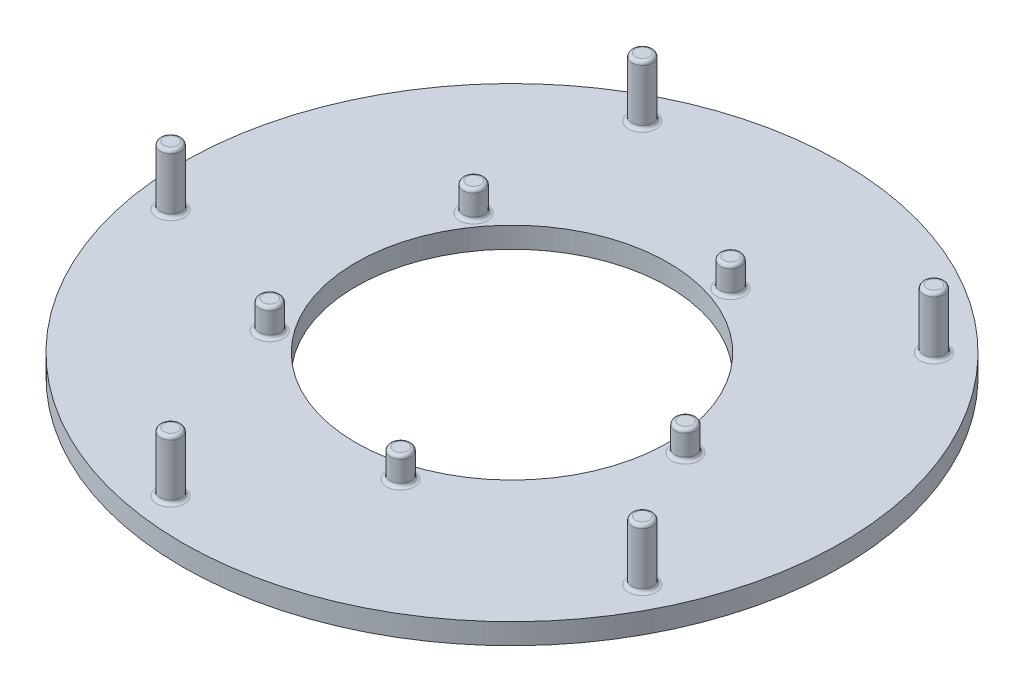
ISO-10303-21;
HEADER;
FILE_DESCRIPTION(('STEP AP214'),'2;1');
FILE_NAME('part.step','',(''),(''),'','','');
FILE_SCHEMA(('AUTOMOTIVE_DESIGN { 1 0 10303 214 1 1 1 1 }'));
ENDSEC;
DATA;
#1=APPLICATION_CONTEXT('core data for automotive mechanical design processes');
#2=APPLICATION_PROTOCOL_DEFINITION('international standard','automotive_design',2000,#1);
#3=PRODUCT_CONTEXT('',#1,'mechanical');
#4=PRODUCT('Part','Part','',(#3));
#5=PRODUCT_RELATED_PRODUCT_CATEGORY('part','',(#4));
#6=PRODUCT_DEFINITION_FORMATION('','',#4);
#7=PRODUCT_DEFINITION_CONTEXT('part definition',#1,'design');
#8=PRODUCT_DEFINITION('design','',#6,#7);
#9=PRODUCT_DEFINITION_SHAPE('','',#8);
#10=(LENGTH_UNIT() NAMED_UNIT(*) SI_UNIT(.MILLI.,.METRE.));
#11=(NAMED_UNIT(*) PLANE_ANGLE_UNIT() SI_UNIT($,.RADIAN.));
#12=(NAMED_UNIT(*) SI_UNIT($,.STERADIAN.) SOLID_ANGLE_UNIT());
#13=UNCERTAINTY_MEASURE_WITH_UNIT(LENGTH_MEASURE(1.E-05),#10,'distance_accuracy_value','');
#14=(GEOMETRIC_REPRESENTATION_CONTEXT(3) GLOBAL_UNCERTAINTY_ASSIGNED_CONTEXT((#13)) GLOBAL_UNIT_ASSIGNED_CONTEXT((#10,
#11,#12)) REPRESENTATION_CONTEXT('',''));
#15=CARTESIAN_POINT('',(0.,0.,0.));
#16=DIRECTION('',(0.,0.,1.));
#17=DIRECTION('',(1.,0.,0.));
#18=AXIS2_PLACEMENT_3D('',#15,#16,#17);
#19=CARTESIAN_POINT('',(0.,3.,0.));
#20=DIRECTION('',(0.,1.,0.));
#21=DIRECTION('',(0.,0.,1.));
#22=AXIS2_PLACEMENT_3D('',#19,#20,#21);
#23=PLANE('',#22);
#24=CARTESIAN_POINT('',(38.3132805401001,3.,19.5215914888));
#25=DIRECTION('',(0.,1.,0.));
#26=DIRECTION('',(0.,0.,1.));
#27=AXIS2_PLACEMENT_3D('',#24,#25,#26);
#28=CIRCLE('',#27,2.00000000000001);
#29=CARTESIAN_POINT('',(38.3132805401001,3.,21.5215914888));
#30=VERTEX_POINT('',#29);
#31=EDGE_CURVE('E79',#30,#30,#28,.F.);
#32=ORIENTED_EDGE('',*,*,#31,.T.);
#33=EDGE_LOOP('',(#32));
#34=FACE_BOUND('',#33,.T.);
#35=CARTESIAN_POINT('',(7.72542485937396,3.,23.7764129073788));
#36=DIRECTION('',(0.,1.,0.));
#37=DIRECTION('',(0.,0.,1.));
#38=AXIS2_PLACEMENT_3D('',#35,#36,#37);
#39=CIRCLE('',#38,2.);
#40=CARTESIAN_POINT('',(7.72542485937396,3.,25.7764129073788));
#41=VERTEX_POINT('',#40);
#42=EDGE_CURVE('E83',#41,#41,#39,.F.);
#43=ORIENTED_EDGE('',*,*,#42,.T.);
#44=EDGE_LOOP('',(#43));
#45=FACE_BOUND('',#44,.T.);
#46=CARTESIAN_POINT('',(-6.72668199672947,3.,42.470598645591));
#47=DIRECTION('',(0.,1.,0.));
#48=DIRECTION('',(0.,0.,1.));
#49=AXIS2_PLACEMENT_3D('',#46,#47,#48);
#50=CIRCLE('',#49,2.00000000000001);
#51=CARTESIAN_POINT('',(-6.72668199672947,3.,44.470598645591));
#52=VERTEX_POINT('',#51);
#53=EDGE_CURVE('E103',#52,#52,#50,.F.);
#54=ORIENTED_EDGE('',*,*,#53,.T.);
#55=EDGE_LOOP('',(#54));
#56=FACE_BOUND('',#55,.T.);
#57=CARTESIAN_POINT('',(-20.2254248593736,3.,14.694631307312));
#58=DIRECTION('',(0.,1.,0.));
#59=DIRECTION('',(0.,0.,1.));
#60=AXIS2_PLACEMENT_3D('',#57,#58,#59);
#61=CIRCLE('',#60,2.);
#62=CARTESIAN_POINT('',(-20.2254248593736,3.,16.694631307312));
#63=VERTEX_POINT('',#62);
#64=EDGE_CURVE('E107',#63,#63,#61,.F.);
#65=ORIENTED_EDGE('',*,*,#64,.T.);
#66=EDGE_LOOP('',(#65));
#67=FACE_BOUND('',#66,.T.);
#68=CARTESIAN_POINT('',(-42.4705986455909,3.,6.72668199673025));
#69=DIRECTION('',(0.,1.,0.));
#70=DIRECTION('',(0.,0.,1.));
#71=AXIS2_PLACEMENT_3D('',#68,#69,#70);
#72=CIRCLE('',#71,2.00000000000001);
#73=CARTESIAN_POINT('',(-42.4705986455909,3.,8.72668199673025));
#74=VERTEX_POINT('',#73);
#75=EDGE_CURVE('E127',#74,#74,#72,.F.);
#76=ORIENTED_EDGE('',*,*,#75,.T.);
#77=EDGE_LOOP('',(#76));
#78=FACE_BOUND('',#77,.T.);
#79=CARTESIAN_POINT('',(-20.2254248593738,3.,-14.6946313073117));
#80=DIRECTION('',(0.,1.,0.));
#81=DIRECTION('',(0.,0.,1.));
#82=AXIS2_PLACEMENT_3D('',#79,#80,#81);
#83=CIRCLE('',#82,2.);
#84=CARTESIAN_POINT('',(-20.2254248593738,3.,-12.6946313073117));
#85=VERTEX_POINT('',#84);
#86=EDGE_CURVE('E131',#85,#85,#83,.F.);
#87=ORIENTED_EDGE('',*,*,#86,.T.);
#88=EDGE_LOOP('',(#87));
#89=FACE_BOUND('',#88,.T.);
#90=CARTESIAN_POINT('',(-19.5215914888007,3.,-38.3132805400997));
#91=DIRECTION('',(0.,1.,0.));
#92=DIRECTION('',(0.,0.,1.));
#93=AXIS2_PLACEMENT_3D('',#90,#91,#92);
#94=CIRCLE('',#93,2.00000000000001);
#95=CARTESIAN_POINT('',(-19.5215914888007,3.,-36.3132805400997));
#96=VERTEX_POINT('',#95);
#97=EDGE_CURVE('E151',#96,#96,#94,.F.);
#98=ORIENTED_EDGE('',*,*,#97,.T.);
#99=EDGE_LOOP('',(#98));
#100=FACE_BOUND('',#99,.T.);
#101=CARTESIAN_POINT('',(7.72542485937362,3.,-23.7764129073789));
#102=DIRECTION('',(0.,1.,0.));
#103=DIRECTION('',(0.,0.,1.));
#104=AXIS2_PLACEMENT_3D('',#101,#102,#103);
#105=CIRCLE('',#104,2.);
#106=CARTESIAN_POINT('',(7.72542485937362,3.,-21.7764129073789));
#107=VERTEX_POINT('',#106);
#108=EDGE_CURVE('E155',#107,#107,#105,.F.);
#109=ORIENTED_EDGE('',*,*,#108,.T.);
#110=EDGE_LOOP('',(#109));
#111=FACE_BOUND('',#110,.T.);
#112=CARTESIAN_POINT('',(30.4055915910215,3.,-30.4055915910216));
#113=DIRECTION('',(0.,1.,0.));
#114=DIRECTION('',(0.,0.,1.));
#115=AXIS2_PLACEMENT_3D('',#112,#113,#114);
#116=CIRCLE('',#115,2.00000000000001);
#117=CARTESIAN_POINT('',(30.4055915910215,3.,-28.4055915910216));
#118=VERTEX_POINT('',#117);
#119=EDGE_CURVE('E183',#118,#118,#116,.F.);
#120=ORIENTED_EDGE('',*,*,#119,.T.);
#121=EDGE_LOOP('',(#120));
#122=FACE_BOUND('',#121,.T.);
#123=CARTESIAN_POINT('',(25.,3.,0.));
#124=DIRECTION('',(0.,1.,0.));
#125=DIRECTION('',(0.,0.,1.));
#126=AXIS2_PLACEMENT_3D('',#123,#124,#125);
#127=CIRCLE('',#126,2.);
#128=CARTESIAN_POINT('',(25.,3.,2.));
#129=VERTEX_POINT('',#128);
#130=EDGE_CURVE('E187',#129,#129,#127,.F.);
#131=ORIENTED_EDGE('',*,*,#130,.T.);
#132=EDGE_LOOP('',(#131));
#133=FACE_BOUND('',#132,.T.);
#134=CARTESIAN_POINT('',(0.,3.,0.));
#135=DIRECTION('',(0.,1.,0.));
#136=DIRECTION('',(0.,0.,1.));
#137=AXIS2_PLACEMENT_3D('',#134,#135,#136);
#138=CIRCLE('',#137,47.5);
#139=CARTESIAN_POINT('',(0.,3.,47.5));
#140=VERTEX_POINT('',#139);
#141=EDGE_CURVE('E207',#140,#140,#138,.T.);
#142=ORIENTED_EDGE('',*,*,#141,.T.);
#143=EDGE_LOOP('',(#142));
#144=FACE_BOUND('',#143,.T.);
#145=CARTESIAN_POINT('',(0.,3.,0.));
#146=DIRECTION('',(0.,1.,0.));
#147=DIRECTION('',(0.,0.,1.));
#148=AXIS2_PLACEMENT_3D('',#145,#146,#147);
#149=CIRCLE('',#148,22.5);
#150=CARTESIAN_POINT('',(0.,3.,22.5));
#151=VERTEX_POINT('',#150);
#152=EDGE_CURVE('E212',#151,#151,#149,.T.);
#153=ORIENTED_EDGE('',*,*,#152,.F.);
#154=EDGE_LOOP('',(#153));
#155=FACE_BOUND('',#154,.T.);
#156=ADVANCED_FACE('F39',(#34,#45,#56,#67,#78,#89,#100,#111,#122,#133,#144,#155),#23,.T.);
#157=CARTESIAN_POINT('',(0.,0.,0.));
#158=DIRECTION('',(0.,1.,0.));
#159=DIRECTION('',(0.,0.,1.));
#160=AXIS2_PLACEMENT_3D('',#157,#158,#159);
#161=PLANE('',#160);
#162=CARTESIAN_POINT('',(0.,0.,0.));
#163=DIRECTION('',(0.,1.,0.));
#164=DIRECTION('',(0.,0.,1.));
#165=AXIS2_PLACEMENT_3D('',#162,#163,#164);
#166=CIRCLE('',#165,47.5);
#167=CARTESIAN_POINT('',(0.,0.,47.5));
#168=VERTEX_POINT('',#167);
#169=EDGE_CURVE('E208',#168,#168,#166,.T.);
#170=ORIENTED_EDGE('',*,*,#169,.F.);
#171=EDGE_LOOP('',(#170));
#172=FACE_BOUND('',#171,.T.);
#173=CARTESIAN_POINT('',(0.,0.,0.));
#174=DIRECTION('',(0.,1.,0.));
#175=DIRECTION('',(0.,0.,1.));
#176=AXIS2_PLACEMENT_3D('',#173,#174,#175);
#177=CIRCLE('',#176,22.5);
#178=CARTESIAN_POINT('',(0.,0.,22.5));
#179=VERTEX_POINT('',#178);
#180=EDGE_CURVE('E216',#179,#179,#177,.T.);
#181=ORIENTED_EDGE('',*,*,#180,.T.);
#182=EDGE_LOOP('',(#181));
#183=FACE_BOUND('',#182,.T.);
#184=ADVANCED_FACE('F228',(#172,#183),#161,.F.);
#185=CARTESIAN_POINT('',(0.,3.,0.));
#186=DIRECTION('',(0.,-1.,0.));
#187=DIRECTION('',(0.,0.,-1.));
#188=AXIS2_PLACEMENT_3D('',#185,#186,#187);
#189=CYLINDRICAL_SURFACE('',#188,47.5);
#190=ORIENTED_EDGE('',*,*,#141,.F.);
#191=EDGE_LOOP('',(#190));
#192=FACE_BOUND('',#191,.T.);
#193=ORIENTED_EDGE('',*,*,#169,.T.);
#194=EDGE_LOOP('',(#193));
#195=FACE_BOUND('',#194,.T.);
#196=ADVANCED_FACE('F234',(#192,#195),#189,.T.);
#197=CARTESIAN_POINT('',(0.,3.,0.));
#198=DIRECTION('',(0.,-1.,0.));
#199=DIRECTION('',(0.,0.,-1.));
#200=AXIS2_PLACEMENT_3D('',#197,#198,#199);
#201=CYLINDRICAL_SURFACE('',#200,22.5);
#202=ORIENTED_EDGE('',*,*,#152,.T.);
#203=EDGE_LOOP('',(#202));
#204=FACE_BOUND('',#203,.T.);
#205=ORIENTED_EDGE('',*,*,#180,.F.);
#206=EDGE_LOOP('',(#205));
#207=FACE_BOUND('',#206,.T.);
#208=ADVANCED_FACE('F224',(#204,#207),#201,.F.);
#209=CARTESIAN_POINT('',(25.,7.,0.));
#210=DIRECTION('',(0.,-1.,0.));
#211=DIRECTION('',(0.,0.,-1.));
#212=AXIS2_PLACEMENT_3D('',#209,#210,#211);
#213=CYLINDRICAL_SURFACE('',#212,1.5);
#214=CARTESIAN_POINT('',(25.,6.5,0.));
#215=DIRECTION('',(0.,1.,0.));
#216=DIRECTION('',(0.,0.,1.));
#217=AXIS2_PLACEMENT_3D('',#214,#215,#216);
#218=CIRCLE('',#217,1.5);
#219=CARTESIAN_POINT('',(25.,6.5,1.5));
#220=VERTEX_POINT('',#219);
#221=EDGE_CURVE('E195',#220,#220,#218,.F.);
#222=ORIENTED_EDGE('',*,*,#221,.T.);
#223=EDGE_LOOP('',(#222));
#224=FACE_BOUND('',#223,.T.);
#225=CARTESIAN_POINT('',(25.,3.5,0.));
#226=DIRECTION('',(0.,1.,0.));
#227=DIRECTION('',(0.,0.,1.));
#228=AXIS2_PLACEMENT_3D('',#225,#226,#227);
#229=CIRCLE('',#228,1.5);
#230=CARTESIAN_POINT('',(25.,3.5,1.5));
#231=VERTEX_POINT('',#230);
#232=EDGE_CURVE('E199',#231,#231,#229,.T.);
#233=ORIENTED_EDGE('',*,*,#232,.T.);
#234=EDGE_LOOP('',(#233));
#235=FACE_BOUND('',#234,.T.);
#236=ADVANCED_FACE('F400',(#224,#235),#213,.T.);
#237=CARTESIAN_POINT('',(25.,7.,0.));
#238=DIRECTION('',(0.,1.,0.));
#239=DIRECTION('',(0.,0.,1.));
#240=AXIS2_PLACEMENT_3D('',#237,#238,#239);
#241=PLANE('',#240);
#242=CARTESIAN_POINT('',(25.,7.,0.));
#243=DIRECTION('',(0.,1.,0.));
#244=DIRECTION('',(0.,0.,1.));
#245=AXIS2_PLACEMENT_3D('',#242,#243,#244);
#246=CIRCLE('',#245,1.);
#247=CARTESIAN_POINT('',(25.,7.,1.));
#248=VERTEX_POINT('',#247);
#249=EDGE_CURVE('E203',#248,#248,#246,.T.);
#250=ORIENTED_EDGE('',*,*,#249,.T.);
#251=EDGE_LOOP('',(#250));
#252=FACE_BOUND('',#251,.T.);
#253=ADVANCED_FACE('F397',(#252),#241,.T.);
#254=CARTESIAN_POINT('',(30.4055915910215,7.,-30.4055915910216));
#255=DIRECTION('',(0.,-1.,0.));
#256=DIRECTION('',(0.,0.,-1.));
#257=AXIS2_PLACEMENT_3D('',#254,#255,#256);
#258=CYLINDRICAL_SURFACE('',#257,1.50000000000001);
#259=CARTESIAN_POINT('',(30.4055915910215,11.,-30.4055915910216));
#260=DIRECTION('',(0.,1.,0.));
#261=DIRECTION('',(0.,0.,1.));
#262=AXIS2_PLACEMENT_3D('',#259,#260,#261);
#263=CIRCLE('',#262,1.50000000000001);
#264=CARTESIAN_POINT('',(30.4055915910215,11.,-28.9055915910216));
#265=VERTEX_POINT('',#264);
#266=EDGE_CURVE('E175',#265,#265,#263,.F.);
#267=ORIENTED_EDGE('',*,*,#266,.T.);
#268=EDGE_LOOP('',(#267));
#269=FACE_BOUND('',#268,.T.);
#270=CARTESIAN_POINT('',(30.4055915910215,3.5,-30.4055915910216));
#271=DIRECTION('',(0.,1.,0.));
#272=DIRECTION('',(0.,0.,1.));
#273=AXIS2_PLACEMENT_3D('',#270,#271,#272);
#274=CIRCLE('',#273,1.50000000000001);
#275=CARTESIAN_POINT('',(30.4055915910215,3.5,-28.9055915910216));
#276=VERTEX_POINT('',#275);
#277=EDGE_CURVE('E191',#276,#276,#274,.T.);
#278=ORIENTED_EDGE('',*,*,#277,.T.);
#279=EDGE_LOOP('',(#278));
#280=FACE_BOUND('',#279,.T.);
#281=ADVANCED_FACE('F248',(#269,#280),#258,.T.);
#282=CARTESIAN_POINT('',(25.,6.5,0.));
#283=DIRECTION('',(0.,1.,0.));
#284=DIRECTION('',(0.,0.,1.));
#285=AXIS2_PLACEMENT_3D('',#282,#283,#284);
#286=TOROIDAL_SURFACE('',#285,1.,0.5);
#287=ORIENTED_EDGE('',*,*,#221,.F.);
#288=EDGE_LOOP('',(#287));
#289=FACE_BOUND('',#288,.T.);
#290=ORIENTED_EDGE('',*,*,#249,.F.);
#291=EDGE_LOOP('',(#290));
#292=FACE_BOUND('',#291,.T.);
#293=ADVANCED_FACE('F244',(#289,#292),#286,.T.);
#294=CARTESIAN_POINT('',(30.4055915910215,3.5,-30.4055915910216));
#295=DIRECTION('',(0.,1.,0.));
#296=DIRECTION('',(0.,0.,1.));
#297=AXIS2_PLACEMENT_3D('',#294,#295,#296);
#298=TOROIDAL_SURFACE('',#297,2.00000000000001,0.5);
#299=ORIENTED_EDGE('',*,*,#119,.F.);
#300=EDGE_LOOP('',(#299));
#301=FACE_BOUND('',#300,.T.);
#302=ORIENTED_EDGE('',*,*,#277,.F.);
#303=EDGE_LOOP('',(#302));
#304=FACE_BOUND('',#303,.T.);
#305=ADVANCED_FACE('F247',(#301,#304),#298,.F.);
#306=CARTESIAN_POINT('',(25.,3.5,0.));
#307=DIRECTION('',(0.,1.,0.));
#308=DIRECTION('',(0.,0.,1.));
#309=AXIS2_PLACEMENT_3D('',#306,#307,#308);
#310=TOROIDAL_SURFACE('',#309,2.,0.5);
#311=ORIENTED_EDGE('',*,*,#130,.F.);
#312=EDGE_LOOP('',(#311));
#313=FACE_BOUND('',#312,.T.);
#314=ORIENTED_EDGE('',*,*,#232,.F.);
#315=EDGE_LOOP('',(#314));
#316=FACE_BOUND('',#315,.T.);
#317=ADVANCED_FACE('F252',(#313,#316),#310,.F.);
#318=CARTESIAN_POINT('',(30.4055915910215,11.5,-30.4055915910216));
#319=DIRECTION('',(0.,1.,0.));
#320=DIRECTION('',(0.,0.,1.));
#321=AXIS2_PLACEMENT_3D('',#318,#319,#320);
#322=PLANE('',#321);
#323=CARTESIAN_POINT('',(30.4055915910215,11.5,-30.4055915910216));
#324=DIRECTION('',(0.,1.,0.));
#325=DIRECTION('',(0.,0.,1.));
#326=AXIS2_PLACEMENT_3D('',#323,#324,#325);
#327=CIRCLE('',#326,1.00000000000001);
#328=CARTESIAN_POINT('',(30.4055915910215,11.5,-29.4055915910216));
#329=VERTEX_POINT('',#328);
#330=EDGE_CURVE('E179',#329,#329,#327,.T.);
#331=ORIENTED_EDGE('',*,*,#330,.T.);
#332=EDGE_LOOP('',(#331));
#333=FACE_BOUND('',#332,.T.);
#334=ADVANCED_FACE('F256',(#333),#322,.T.);
#335=CARTESIAN_POINT('',(30.4055915910215,11.,-30.4055915910216));
#336=DIRECTION('',(0.,1.,0.));
#337=DIRECTION('',(0.,0.,1.));
#338=AXIS2_PLACEMENT_3D('',#335,#336,#337);
#339=TOROIDAL_SURFACE('',#338,1.00000000000001,0.5);
#340=ORIENTED_EDGE('',*,*,#266,.F.);
#341=EDGE_LOOP('',(#340));
#342=FACE_BOUND('',#341,.T.);
#343=ORIENTED_EDGE('',*,*,#330,.F.);
#344=EDGE_LOOP('',(#343));
#345=FACE_BOUND('',#344,.T.);
#346=ADVANCED_FACE('F258',(#342,#345),#339,.T.);
#347=CARTESIAN_POINT('',(7.72542485937362,7.,-23.7764129073789));
#348=DIRECTION('',(0.,-1.,0.));
#349=DIRECTION('',(0.,0.,-1.));
#350=AXIS2_PLACEMENT_3D('',#347,#348,#349);
#351=CYLINDRICAL_SURFACE('',#350,1.5);
#352=CARTESIAN_POINT('',(7.72542485937362,6.5,-23.7764129073789));
#353=DIRECTION('',(0.,1.,0.));
#354=DIRECTION('',(0.,0.,1.));
#355=AXIS2_PLACEMENT_3D('',#352,#353,#354);
#356=CIRCLE('',#355,1.5);
#357=CARTESIAN_POINT('',(7.72542485937362,6.5,-22.2764129073789));
#358=VERTEX_POINT('',#357);
#359=EDGE_CURVE('E163',#358,#358,#356,.F.);
#360=ORIENTED_EDGE('',*,*,#359,.T.);
#361=EDGE_LOOP('',(#360));
#362=FACE_BOUND('',#361,.T.);
#363=CARTESIAN_POINT('',(7.72542485937362,3.5,-23.7764129073789));
#364=DIRECTION('',(0.,1.,0.));
#365=DIRECTION('',(0.,0.,1.));
#366=AXIS2_PLACEMENT_3D('',#363,#364,#365);
#367=CIRCLE('',#366,1.5);
#368=CARTESIAN_POINT('',(7.72542485937362,3.5,-22.2764129073789));
#369=VERTEX_POINT('',#368);
#370=EDGE_CURVE('E167',#369,#369,#367,.T.);
#371=ORIENTED_EDGE('',*,*,#370,.T.);
#372=EDGE_LOOP('',(#371));
#373=FACE_BOUND('',#372,.T.);
#374=ADVANCED_FACE('F261',(#362,#373),#351,.T.);
#375=CARTESIAN_POINT('',(7.72542485937362,7.,-23.7764129073789));
#376=DIRECTION('',(0.,1.,0.));
#377=DIRECTION('',(0.951056516295155,0.,0.309016994374945));
#378=AXIS2_PLACEMENT_3D('',#375,#376,#377);
#379=PLANE('',#378);
#380=CARTESIAN_POINT('',(7.72542485937362,7.,-23.7764129073789));
#381=DIRECTION('',(0.,1.,0.));
#382=DIRECTION('',(0.,0.,1.));
#383=AXIS2_PLACEMENT_3D('',#380,#381,#382);
#384=CIRCLE('',#383,1.);
#385=CARTESIAN_POINT('',(7.72542485937362,7.,-22.7764129073789));
#386=VERTEX_POINT('',#385);
#387=EDGE_CURVE('E171',#386,#386,#384,.T.);
#388=ORIENTED_EDGE('',*,*,#387,.T.);
#389=EDGE_LOOP('',(#388));
#390=FACE_BOUND('',#389,.T.);
#391=ADVANCED_FACE('F384',(#390),#379,.T.);
#392=CARTESIAN_POINT('',(-19.5215914888007,7.,-38.3132805400997));
#393=DIRECTION('',(0.,-1.,0.));
#394=DIRECTION('',(0.,0.,-1.));
#395=AXIS2_PLACEMENT_3D('',#392,#393,#394);
#396=CYLINDRICAL_SURFACE('',#395,1.50000000000001);
#397=CARTESIAN_POINT('',(-19.5215914888007,11.,-38.3132805400997));
#398=DIRECTION('',(0.,1.,0.));
#399=DIRECTION('',(0.,0.,1.));
#400=AXIS2_PLACEMENT_3D('',#397,#398,#399);
#401=CIRCLE('',#400,1.50000000000001);
#402=CARTESIAN_POINT('',(-19.5215914888007,11.,-36.8132805400997));
#403=VERTEX_POINT('',#402);
#404=EDGE_CURVE('E71',#403,#403,#401,.F.);
#405=ORIENTED_EDGE('',*,*,#404,.T.);
#406=EDGE_LOOP('',(#405));
#407=FACE_BOUND('',#406,.T.);
#408=CARTESIAN_POINT('',(-19.5215914888007,3.5,-38.3132805400997));
#409=DIRECTION('',(0.,1.,0.));
#410=DIRECTION('',(0.,0.,1.));
#411=AXIS2_PLACEMENT_3D('',#408,#409,#410);
#412=CIRCLE('',#411,1.50000000000001);
#413=CARTESIAN_POINT('',(-19.5215914888007,3.5,-36.8132805400997));
#414=VERTEX_POINT('',#413);
#415=EDGE_CURVE('E159',#414,#414,#412,.T.);
#416=ORIENTED_EDGE('',*,*,#415,.T.);
#417=EDGE_LOOP('',(#416));
#418=FACE_BOUND('',#417,.T.);
#419=ADVANCED_FACE('F380',(#407,#418),#396,.T.);
#420=CARTESIAN_POINT('',(-20.2254248593738,7.,-14.6946313073117));
#421=DIRECTION('',(0.,-1.,0.));
#422=DIRECTION('',(0.,0.,-1.));
#423=AXIS2_PLACEMENT_3D('',#420,#421,#422);
#424=CYLINDRICAL_SURFACE('',#423,1.5);
#425=CARTESIAN_POINT('',(-20.2254248593738,6.5,-14.6946313073117));
#426=DIRECTION('',(0.,1.,0.));
#427=DIRECTION('',(0.,0.,1.));
#428=AXIS2_PLACEMENT_3D('',#425,#426,#427);
#429=CIRCLE('',#428,1.5);
#430=CARTESIAN_POINT('',(-20.2254248593738,6.5,-13.1946313073117));
#431=VERTEX_POINT('',#430);
#432=EDGE_CURVE('E139',#431,#431,#429,.F.);
#433=ORIENTED_EDGE('',*,*,#432,.T.);
#434=EDGE_LOOP('',(#433));
#435=FACE_BOUND('',#434,.T.);
#436=CARTESIAN_POINT('',(-20.2254248593738,3.5,-14.6946313073117));
#437=DIRECTION('',(0.,1.,0.));
#438=DIRECTION('',(0.,0.,1.));
#439=AXIS2_PLACEMENT_3D('',#436,#437,#438);
#440=CIRCLE('',#439,1.5);
#441=CARTESIAN_POINT('',(-20.2254248593738,3.5,-13.1946313073117));
#442=VERTEX_POINT('',#441);
#443=EDGE_CURVE('E143',#442,#442,#440,.T.);
#444=ORIENTED_EDGE('',*,*,#443,.T.);
#445=EDGE_LOOP('',(#444));
#446=FACE_BOUND('',#445,.T.);
#447=ADVANCED_FACE('F376',(#435,#446),#424,.T.);
#448=CARTESIAN_POINT('',(-20.2254248593738,7.,-14.6946313073117));
#449=DIRECTION('',(0.,1.,0.));
#450=DIRECTION('',(0.587785252292469,0.,-0.809016994374951));
#451=AXIS2_PLACEMENT_3D('',#448,#449,#450);
#452=PLANE('',#451);
#453=CARTESIAN_POINT('',(-20.2254248593738,7.,-14.6946313073117));
#454=DIRECTION('',(0.,1.,0.));
#455=DIRECTION('',(0.,0.,1.));
#456=AXIS2_PLACEMENT_3D('',#453,#454,#455);
#457=CIRCLE('',#456,1.);
#458=CARTESIAN_POINT('',(-20.2254248593738,7.,-13.6946313073117));
#459=VERTEX_POINT('',#458);
#460=EDGE_CURVE('E147',#459,#459,#457,.T.);
#461=ORIENTED_EDGE('',*,*,#460,.T.);
#462=EDGE_LOOP('',(#461));
#463=FACE_BOUND('',#462,.T.);
#464=ADVANCED_FACE('F372',(#463),#452,.T.);
#465=CARTESIAN_POINT('',(-42.4705986455909,7.,6.72668199673025));
#466=DIRECTION('',(0.,-1.,0.));
#467=DIRECTION('',(0.,0.,-1.));
#468=AXIS2_PLACEMENT_3D('',#465,#466,#467);
#469=CYLINDRICAL_SURFACE('',#468,1.50000000000001);
#470=CARTESIAN_POINT('',(-42.4705986455909,11.,6.72668199673025));
#471=DIRECTION('',(0.,1.,0.));
#472=DIRECTION('',(0.,0.,1.));
#473=AXIS2_PLACEMENT_3D('',#470,#471,#472);
#474=CIRCLE('',#473,1.50000000000001);
#475=CARTESIAN_POINT('',(-42.4705986455909,11.,8.22668199673026));
#476=VERTEX_POINT('',#475);
#477=EDGE_CURVE('E63',#476,#476,#474,.F.);
#478=ORIENTED_EDGE('',*,*,#477,.T.);
#479=EDGE_LOOP('',(#478));
#480=FACE_BOUND('',#479,.T.);
#481=CARTESIAN_POINT('',(-42.4705986455909,3.5,6.72668199673025));
#482=DIRECTION('',(0.,1.,0.));
#483=DIRECTION('',(0.,0.,1.));
#484=AXIS2_PLACEMENT_3D('',#481,#482,#483);
#485=CIRCLE('',#484,1.50000000000001);
#486=CARTESIAN_POINT('',(-42.4705986455909,3.5,8.22668199673026));
#487=VERTEX_POINT('',#486);
#488=EDGE_CURVE('E135',#487,#487,#485,.T.);
#489=ORIENTED_EDGE('',*,*,#488,.T.);
#490=EDGE_LOOP('',(#489));
#491=FACE_BOUND('',#490,.T.);
#492=ADVANCED_FACE('F368',(#480,#491),#469,.T.);
#493=CARTESIAN_POINT('',(-20.2254248593736,7.,14.694631307312));
#494=DIRECTION('',(0.,-1.,0.));
#495=DIRECTION('',(0.,0.,-1.));
#496=AXIS2_PLACEMENT_3D('',#493,#494,#495);
#497=CYLINDRICAL_SURFACE('',#496,1.5);
#498=CARTESIAN_POINT('',(-20.2254248593736,6.5,14.694631307312));
#499=DIRECTION('',(0.,1.,0.));
#500=DIRECTION('',(0.,0.,1.));
#501=AXIS2_PLACEMENT_3D('',#498,#499,#500);
#502=CIRCLE('',#501,1.5);
#503=CARTESIAN_POINT('',(-20.2254248593736,6.5,16.194631307312));
#504=VERTEX_POINT('',#503);
#505=EDGE_CURVE('E115',#504,#504,#502,.F.);
#506=ORIENTED_EDGE('',*,*,#505,.T.);
#507=EDGE_LOOP('',(#506));
#508=FACE_BOUND('',#507,.T.);
#509=CARTESIAN_POINT('',(-20.2254248593736,3.5,14.694631307312));
#510=DIRECTION('',(0.,1.,0.));
#511=DIRECTION('',(0.,0.,1.));
#512=AXIS2_PLACEMENT_3D('',#509,#510,#511);
#513=CIRCLE('',#512,1.5);
#514=CARTESIAN_POINT('',(-20.2254248593736,3.5,16.194631307312));
#515=VERTEX_POINT('',#514);
#516=EDGE_CURVE('E119',#515,#515,#513,.T.);
#517=ORIENTED_EDGE('',*,*,#516,.T.);
#518=EDGE_LOOP('',(#517));
#519=FACE_BOUND('',#518,.T.);
#520=ADVANCED_FACE('F364',(#508,#519),#497,.T.);
#521=CARTESIAN_POINT('',(-20.2254248593736,7.,14.694631307312));
#522=DIRECTION('',(0.,1.,0.));
#523=DIRECTION('',(-0.58778525229248,0.,-0.809016994374942));
#524=AXIS2_PLACEMENT_3D('',#521,#522,#523);
#525=PLANE('',#524);
#526=CARTESIAN_POINT('',(-20.2254248593736,7.,14.694631307312));
#527=DIRECTION('',(0.,1.,0.));
#528=DIRECTION('',(0.,0.,1.));
#529=AXIS2_PLACEMENT_3D('',#526,#527,#528);
#530=CIRCLE('',#529,1.);
#531=CARTESIAN_POINT('',(-20.2254248593736,7.,15.694631307312));
#532=VERTEX_POINT('',#531);
#533=EDGE_CURVE('E123',#532,#532,#530,.T.);
#534=ORIENTED_EDGE('',*,*,#533,.T.);
#535=EDGE_LOOP('',(#534));
#536=FACE_BOUND('',#535,.T.);
#537=ADVANCED_FACE('F360',(#536),#525,.T.);
#538=CARTESIAN_POINT('',(-6.72668199672947,7.,42.470598645591));
#539=DIRECTION('',(0.,-1.,0.));
#540=DIRECTION('',(0.,0.,-1.));
#541=AXIS2_PLACEMENT_3D('',#538,#539,#540);
#542=CYLINDRICAL_SURFACE('',#541,1.50000000000001);
#543=CARTESIAN_POINT('',(-6.72668199672947,11.,42.470598645591));
#544=DIRECTION('',(0.,1.,0.));
#545=DIRECTION('',(0.,0.,1.));
#546=AXIS2_PLACEMENT_3D('',#543,#544,#545);
#547=CIRCLE('',#546,1.50000000000001);
#548=CARTESIAN_POINT('',(-6.72668199672947,11.,43.970598645591));
#549=VERTEX_POINT('',#548);
#550=EDGE_CURVE('E52',#549,#549,#547,.F.);
#551=ORIENTED_EDGE('',*,*,#550,.T.);
#552=EDGE_LOOP('',(#551));
#553=FACE_BOUND('',#552,.T.);
#554=CARTESIAN_POINT('',(-6.72668199672947,3.5,42.470598645591));
#555=DIRECTION('',(0.,1.,0.));
#556=DIRECTION('',(0.,0.,1.));
#557=AXIS2_PLACEMENT_3D('',#554,#555,#556);
#558=CIRCLE('',#557,1.50000000000001);
#559=CARTESIAN_POINT('',(-6.72668199672947,3.5,43.970598645591));
#560=VERTEX_POINT('',#559);
#561=EDGE_CURVE('E111',#560,#560,#558,.T.);
#562=ORIENTED_EDGE('',*,*,#561,.T.);
#563=EDGE_LOOP('',(#562));
#564=FACE_BOUND('',#563,.T.);
#565=ADVANCED_FACE('F356',(#553,#564),#542,.T.);
#566=CARTESIAN_POINT('',(7.72542485937396,7.,23.7764129073788));
#567=DIRECTION('',(0.,-1.,0.));
#568=DIRECTION('',(0.,0.,-1.));
#569=AXIS2_PLACEMENT_3D('',#566,#567,#568);
#570=CYLINDRICAL_SURFACE('',#569,1.5);
#571=CARTESIAN_POINT('',(7.72542485937396,6.5,23.7764129073788));
#572=DIRECTION('',(0.,1.,0.));
#573=DIRECTION('',(0.,0.,1.));
#574=AXIS2_PLACEMENT_3D('',#571,#572,#573);
#575=CIRCLE('',#574,1.5);
#576=CARTESIAN_POINT('',(7.72542485937396,6.5,25.2764129073788));
#577=VERTEX_POINT('',#576);
#578=EDGE_CURVE('E91',#577,#577,#575,.F.);
#579=ORIENTED_EDGE('',*,*,#578,.T.);
#580=EDGE_LOOP('',(#579));
#581=FACE_BOUND('',#580,.T.);
#582=CARTESIAN_POINT('',(7.72542485937396,3.5,23.7764129073788));
#583=DIRECTION('',(0.,1.,0.));
#584=DIRECTION('',(0.,0.,1.));
#585=AXIS2_PLACEMENT_3D('',#582,#583,#584);
#586=CIRCLE('',#585,1.5);
#587=CARTESIAN_POINT('',(7.72542485937396,3.5,25.2764129073788));
#588=VERTEX_POINT('',#587);
#589=EDGE_CURVE('E95',#588,#588,#586,.T.);
#590=ORIENTED_EDGE('',*,*,#589,.T.);
#591=EDGE_LOOP('',(#590));
#592=FACE_BOUND('',#591,.T.);
#593=ADVANCED_FACE('F352',(#581,#592),#570,.T.);
#594=CARTESIAN_POINT('',(7.72542485937396,7.,23.7764129073788));
#595=DIRECTION('',(0.,1.,0.));
#596=DIRECTION('',(-0.95105651629515,0.,0.309016994374958));
#597=AXIS2_PLACEMENT_3D('',#594,#595,#596);
#598=PLANE('',#597);
#599=CARTESIAN_POINT('',(7.72542485937396,7.,23.7764129073788));
#600=DIRECTION('',(0.,1.,0.));
#601=DIRECTION('',(0.,0.,1.));
#602=AXIS2_PLACEMENT_3D('',#599,#600,#601);
#603=CIRCLE('',#602,1.);
#604=CARTESIAN_POINT('',(7.72542485937396,7.,24.7764129073788));
#605=VERTEX_POINT('',#604);
#606=EDGE_CURVE('E99',#605,#605,#603,.T.);
#607=ORIENTED_EDGE('',*,*,#606,.T.);
#608=EDGE_LOOP('',(#607));
#609=FACE_BOUND('',#608,.T.);
#610=ADVANCED_FACE('F349',(#609),#598,.T.);
#611=CARTESIAN_POINT('',(38.3132805401001,7.,19.5215914888));
#612=DIRECTION('',(0.,-1.,0.));
#613=DIRECTION('',(0.,0.,-1.));
#614=AXIS2_PLACEMENT_3D('',#611,#612,#613);
#615=CYLINDRICAL_SURFACE('',#614,1.50000000000001);
#616=CARTESIAN_POINT('',(38.3132805401001,11.,19.5215914888));
#617=DIRECTION('',(0.,1.,0.));
#618=DIRECTION('',(0.,0.,1.));
#619=AXIS2_PLACEMENT_3D('',#616,#617,#618);
#620=CIRCLE('',#619,1.50000000000001);
#621=CARTESIAN_POINT('',(38.3132805401001,11.,21.0215914888));
#622=VERTEX_POINT('',#621);
#623=EDGE_CURVE('E10',#622,#622,#620,.F.);
#624=ORIENTED_EDGE('',*,*,#623,.T.);
#625=EDGE_LOOP('',(#624));
#626=FACE_BOUND('',#625,.T.);
#627=CARTESIAN_POINT('',(38.3132805401001,3.5,19.5215914888));
#628=DIRECTION('',(0.,1.,0.));
#629=DIRECTION('',(0.,0.,1.));
#630=AXIS2_PLACEMENT_3D('',#627,#628,#629);
#631=CIRCLE('',#630,1.50000000000001);
#632=CARTESIAN_POINT('',(38.3132805401001,3.5,21.0215914888));
#633=VERTEX_POINT('',#632);
#634=EDGE_CURVE('E87',#633,#633,#631,.T.);
#635=ORIENTED_EDGE('',*,*,#634,.T.);
#636=EDGE_LOOP('',(#635));
#637=FACE_BOUND('',#636,.T.);
#638=ADVANCED_FACE('F267',(#626,#637),#615,.T.);
#639=CARTESIAN_POINT('',(7.72542485937362,6.5,-23.7764129073789));
#640=DIRECTION('',(0.,1.,0.));
#641=DIRECTION('',(0.,0.,1.));
#642=AXIS2_PLACEMENT_3D('',#639,#640,#641);
#643=TOROIDAL_SURFACE('',#642,1.,0.5);
#644=ORIENTED_EDGE('',*,*,#359,.F.);
#645=EDGE_LOOP('',(#644));
#646=FACE_BOUND('',#645,.T.);
#647=ORIENTED_EDGE('',*,*,#387,.F.);
#648=EDGE_LOOP('',(#647));
#649=FACE_BOUND('',#648,.T.);
#650=ADVANCED_FACE('F263',(#646,#649),#643,.T.);
#651=CARTESIAN_POINT('',(-19.5215914888007,3.5,-38.3132805400997));
#652=DIRECTION('',(0.,1.,0.));
#653=DIRECTION('',(0.,0.,1.));
#654=AXIS2_PLACEMENT_3D('',#651,#652,#653);
#655=TOROIDAL_SURFACE('',#654,2.00000000000001,0.5);
#656=ORIENTED_EDGE('',*,*,#97,.F.);
#657=EDGE_LOOP('',(#656));
#658=FACE_BOUND('',#657,.T.);
#659=ORIENTED_EDGE('',*,*,#415,.F.);
#660=EDGE_LOOP('',(#659));
#661=FACE_BOUND('',#660,.T.);
#662=ADVANCED_FACE('F266',(#658,#661),#655,.F.);
#663=CARTESIAN_POINT('',(7.72542485937362,3.5,-23.7764129073789));
#664=DIRECTION('',(0.,1.,0.));
#665=DIRECTION('',(0.,0.,1.));
#666=AXIS2_PLACEMENT_3D('',#663,#664,#665);
#667=TOROIDAL_SURFACE('',#666,2.,0.5);
#668=ORIENTED_EDGE('',*,*,#108,.F.);
#669=EDGE_LOOP('',(#668));
#670=FACE_BOUND('',#669,.T.);
#671=ORIENTED_EDGE('',*,*,#370,.F.);
#672=EDGE_LOOP('',(#671));
#673=FACE_BOUND('',#672,.T.);
#674=ADVANCED_FACE('F271',(#670,#673),#667,.F.);
#675=CARTESIAN_POINT('',(-20.2254248593738,6.5,-14.6946313073117));
#676=DIRECTION('',(0.,1.,0.));
#677=DIRECTION('',(0.,0.,1.));
#678=AXIS2_PLACEMENT_3D('',#675,#676,#677);
#679=TOROIDAL_SURFACE('',#678,1.,0.5);
#680=ORIENTED_EDGE('',*,*,#432,.F.);
#681=EDGE_LOOP('',(#680));
#682=FACE_BOUND('',#681,.T.);
#683=ORIENTED_EDGE('',*,*,#460,.F.);
#684=EDGE_LOOP('',(#683));
#685=FACE_BOUND('',#684,.T.);
#686=ADVANCED_FACE('F275',(#682,#685),#679,.T.);
#687=CARTESIAN_POINT('',(-42.4705986455909,3.5,6.72668199673025));
#688=DIRECTION('',(0.,1.,0.));
#689=DIRECTION('',(0.,0.,1.));
#690=AXIS2_PLACEMENT_3D('',#687,#688,#689);
#691=TOROIDAL_SURFACE('',#690,2.00000000000001,0.5);
#692=ORIENTED_EDGE('',*,*,#75,.F.);
#693=EDGE_LOOP('',(#692));
#694=FACE_BOUND('',#693,.T.);
#695=ORIENTED_EDGE('',*,*,#488,.F.);
#696=EDGE_LOOP('',(#695));
#697=FACE_BOUND('',#696,.T.);
#698=ADVANCED_FACE('F279',(#694,#697),#691,.F.);
#699=CARTESIAN_POINT('',(-20.2254248593738,3.5,-14.6946313073117));
#700=DIRECTION('',(0.,1.,0.));
#701=DIRECTION('',(0.,0.,1.));
#702=AXIS2_PLACEMENT_3D('',#699,#700,#701);
#703=TOROIDAL_SURFACE('',#702,2.,0.5);
#704=ORIENTED_EDGE('',*,*,#86,.F.);
#705=EDGE_LOOP('',(#704));
#706=FACE_BOUND('',#705,.T.);
#707=ORIENTED_EDGE('',*,*,#443,.F.);
#708=EDGE_LOOP('',(#707));
#709=FACE_BOUND('',#708,.T.);
#710=ADVANCED_FACE('F283',(#706,#709),#703,.F.);
#711=CARTESIAN_POINT('',(-20.2254248593736,6.5,14.694631307312));
#712=DIRECTION('',(0.,1.,0.));
#713=DIRECTION('',(0.,0.,1.));
#714=AXIS2_PLACEMENT_3D('',#711,#712,#713);
#715=TOROIDAL_SURFACE('',#714,1.,0.5);
#716=ORIENTED_EDGE('',*,*,#505,.F.);
#717=EDGE_LOOP('',(#716));
#718=FACE_BOUND('',#717,.T.);
#719=ORIENTED_EDGE('',*,*,#533,.F.);
#720=EDGE_LOOP('',(#719));
#721=FACE_BOUND('',#720,.T.);
#722=ADVANCED_FACE('F287',(#718,#721),#715,.T.);
#723=CARTESIAN_POINT('',(-6.72668199672947,3.5,42.470598645591));
#724=DIRECTION('',(0.,1.,0.));
#725=DIRECTION('',(0.,0.,1.));
#726=AXIS2_PLACEMENT_3D('',#723,#724,#725);
#727=TOROIDAL_SURFACE('',#726,2.00000000000001,0.5);
#728=ORIENTED_EDGE('',*,*,#53,.F.);
#729=EDGE_LOOP('',(#728));
#730=FACE_BOUND('',#729,.T.);
#731=ORIENTED_EDGE('',*,*,#561,.F.);
#732=EDGE_LOOP('',(#731));
#733=FACE_BOUND('',#732,.T.);
#734=ADVANCED_FACE('F291',(#730,#733),#727,.F.);
#735=CARTESIAN_POINT('',(-20.2254248593736,3.5,14.694631307312));
#736=DIRECTION('',(0.,1.,0.));
#737=DIRECTION('',(0.,0.,1.));
#738=AXIS2_PLACEMENT_3D('',#735,#736,#737);
#739=TOROIDAL_SURFACE('',#738,2.,0.5);
#740=ORIENTED_EDGE('',*,*,#64,.F.);
#741=EDGE_LOOP('',(#740));
#742=FACE_BOUND('',#741,.T.);
#743=ORIENTED_EDGE('',*,*,#516,.F.);
#744=EDGE_LOOP('',(#743));
#745=FACE_BOUND('',#744,.T.);
#746=ADVANCED_FACE('F295',(#742,#745),#739,.F.);
#747=CARTESIAN_POINT('',(7.72542485937396,6.5,23.7764129073788));
#748=DIRECTION('',(0.,1.,0.));
#749=DIRECTION('',(0.,0.,1.));
#750=AXIS2_PLACEMENT_3D('',#747,#748,#749);
#751=TOROIDAL_SURFACE('',#750,1.,0.5);
#752=ORIENTED_EDGE('',*,*,#578,.F.);
#753=EDGE_LOOP('',(#752));
#754=FACE_BOUND('',#753,.T.);
#755=ORIENTED_EDGE('',*,*,#606,.F.);
#756=EDGE_LOOP('',(#755));
#757=FACE_BOUND('',#756,.T.);
#758=ADVANCED_FACE('F299',(#754,#757),#751,.T.);
#759=CARTESIAN_POINT('',(38.3132805401001,3.5,19.5215914888));
#760=DIRECTION('',(0.,1.,0.));
#761=DIRECTION('',(0.,0.,1.));
#762=AXIS2_PLACEMENT_3D('',#759,#760,#761);
#763=TOROIDAL_SURFACE('',#762,2.00000000000001,0.5);
#764=ORIENTED_EDGE('',*,*,#31,.F.);
#765=EDGE_LOOP('',(#764));
#766=FACE_BOUND('',#765,.T.);
#767=ORIENTED_EDGE('',*,*,#634,.F.);
#768=EDGE_LOOP('',(#767));
#769=FACE_BOUND('',#768,.T.);
#770=ADVANCED_FACE('F303',(#766,#769),#763,.F.);
#771=CARTESIAN_POINT('',(7.72542485937396,3.5,23.7764129073788));
#772=DIRECTION('',(0.,1.,0.));
#773=DIRECTION('',(0.,0.,1.));
#774=AXIS2_PLACEMENT_3D('',#771,#772,#773);
#775=TOROIDAL_SURFACE('',#774,2.,0.5);
#776=ORIENTED_EDGE('',*,*,#42,.F.);
#777=EDGE_LOOP('',(#776));
#778=FACE_BOUND('',#777,.T.);
#779=ORIENTED_EDGE('',*,*,#589,.F.);
#780=EDGE_LOOP('',(#779));
#781=FACE_BOUND('',#780,.T.);
#782=ADVANCED_FACE('F307',(#778,#781),#775,.F.);
#783=CARTESIAN_POINT('',(-19.5215914888007,11.5,-38.3132805400997));
#784=DIRECTION('',(0.,1.,0.));
#785=DIRECTION('',(0.951056516295155,0.,0.309016994374945));
#786=AXIS2_PLACEMENT_3D('',#783,#784,#785);
#787=PLANE('',#786);
#788=CARTESIAN_POINT('',(-19.5215914888007,11.5,-38.3132805400997));
#789=DIRECTION('',(0.,1.,0.));
#790=DIRECTION('',(0.,0.,1.));
#791=AXIS2_PLACEMENT_3D('',#788,#789,#790);
#792=CIRCLE('',#791,1.00000000000001);
#793=CARTESIAN_POINT('',(-19.5215914888007,11.5,-37.3132805400997));
#794=VERTEX_POINT('',#793);
#795=EDGE_CURVE('E75',#794,#794,#792,.T.);
#796=ORIENTED_EDGE('',*,*,#795,.T.);
#797=EDGE_LOOP('',(#796));
#798=FACE_BOUND('',#797,.T.);
#799=ADVANCED_FACE('F311',(#798),#787,.T.);
#800=CARTESIAN_POINT('',(-42.4705986455909,11.5,6.72668199673025));
#801=DIRECTION('',(0.,1.,0.));
#802=DIRECTION('',(0.587785252292469,0.,-0.809016994374951));
#803=AXIS2_PLACEMENT_3D('',#800,#801,#802);
#804=PLANE('',#803);
#805=CARTESIAN_POINT('',(-42.4705986455909,11.5,6.72668199673025));
#806=DIRECTION('',(0.,1.,0.));
#807=DIRECTION('',(0.,0.,1.));
#808=AXIS2_PLACEMENT_3D('',#805,#806,#807);
#809=CIRCLE('',#808,1.00000000000001);
#810=CARTESIAN_POINT('',(-42.4705986455909,11.5,7.72668199673026));
#811=VERTEX_POINT('',#810);
#812=EDGE_CURVE('E67',#811,#811,#809,.T.);
#813=ORIENTED_EDGE('',*,*,#812,.T.);
#814=EDGE_LOOP('',(#813));
#815=FACE_BOUND('',#814,.T.);
#816=ADVANCED_FACE('F334',(#815),#804,.T.);
#817=CARTESIAN_POINT('',(-6.72668199672947,11.5,42.470598645591));
#818=DIRECTION('',(0.,1.,0.));
#819=DIRECTION('',(-0.58778525229248,0.,-0.809016994374942));
#820=AXIS2_PLACEMENT_3D('',#817,#818,#819);
#821=PLANE('',#820);
#822=CARTESIAN_POINT('',(-6.72668199672947,11.5,42.470598645591));
#823=DIRECTION('',(0.,1.,0.));
#824=DIRECTION('',(0.,0.,1.));
#825=AXIS2_PLACEMENT_3D('',#822,#823,#824);
#826=CIRCLE('',#825,1.00000000000001);
#827=CARTESIAN_POINT('',(-6.72668199672947,11.5,43.470598645591));
#828=VERTEX_POINT('',#827);
#829=EDGE_CURVE('E57',#828,#828,#826,.T.);
#830=ORIENTED_EDGE('',*,*,#829,.T.);
#831=EDGE_LOOP('',(#830));
#832=FACE_BOUND('',#831,.T.);
#833=ADVANCED_FACE('F332',(#832),#821,.T.);
#834=CARTESIAN_POINT('',(38.3132805401001,11.5,19.5215914888));
#835=DIRECTION('',(0.,1.,0.));
#836=DIRECTION('',(-0.95105651629515,0.,0.309016994374958));
#837=AXIS2_PLACEMENT_3D('',#834,#835,#836);
#838=PLANE('',#837);
#839=CARTESIAN_POINT('',(38.3132805401001,11.5,19.5215914888));
#840=DIRECTION('',(0.,1.,0.));
#841=DIRECTION('',(0.,0.,1.));
#842=AXIS2_PLACEMENT_3D('',#839,#840,#841);
#843=CIRCLE('',#842,1.00000000000001);
#844=CARTESIAN_POINT('',(38.3132805401001,11.5,20.5215914888));
#845=VERTEX_POINT('',#844);
#846=EDGE_CURVE('E47',#845,#845,#843,.T.);
#847=ORIENTED_EDGE('',*,*,#846,.T.);
#848=EDGE_LOOP('',(#847));
#849=FACE_BOUND('',#848,.T.);
#850=ADVANCED_FACE('F317',(#849),#838,.T.);
#851=CARTESIAN_POINT('',(-19.5215914888007,11.,-38.3132805400997));
#852=DIRECTION('',(0.,1.,0.));
#853=DIRECTION('',(0.,0.,1.));
#854=AXIS2_PLACEMENT_3D('',#851,#852,#853);
#855=TOROIDAL_SURFACE('',#854,1.00000000000001,0.5);
#856=ORIENTED_EDGE('',*,*,#404,.F.);
#857=EDGE_LOOP('',(#856));
#858=FACE_BOUND('',#857,.T.);
#859=ORIENTED_EDGE('',*,*,#795,.F.);
#860=EDGE_LOOP('',(#859));
#861=FACE_BOUND('',#860,.T.);
#862=ADVANCED_FACE('F313',(#858,#861),#855,.T.);
#863=CARTESIAN_POINT('',(-42.4705986455909,11.,6.72668199673025));
#864=DIRECTION('',(0.,1.,0.));
#865=DIRECTION('',(0.,0.,1.));
#866=AXIS2_PLACEMENT_3D('',#863,#864,#865);
#867=TOROIDAL_SURFACE('',#866,1.00000000000001,0.5);
#868=ORIENTED_EDGE('',*,*,#477,.F.);
#869=EDGE_LOOP('',(#868));
#870=FACE_BOUND('',#869,.T.);
#871=ORIENTED_EDGE('',*,*,#812,.F.);
#872=EDGE_LOOP('',(#871));
#873=FACE_BOUND('',#872,.T.);
#874=ADVANCED_FACE('F316',(#870,#873),#867,.T.);
#875=CARTESIAN_POINT('',(-6.72668199672947,11.,42.470598645591));
#876=DIRECTION('',(0.,1.,0.));
#877=DIRECTION('',(0.,0.,1.));
#878=AXIS2_PLACEMENT_3D('',#875,#876,#877);
#879=TOROIDAL_SURFACE('',#878,1.00000000000001,0.5);
#880=ORIENTED_EDGE('',*,*,#550,.F.);
#881=EDGE_LOOP('',(#880));
#882=FACE_BOUND('',#881,.T.);
#883=ORIENTED_EDGE('',*,*,#829,.F.);
#884=EDGE_LOOP('',(#883));
#885=FACE_BOUND('',#884,.T.);
#886=ADVANCED_FACE('F320',(#882,#885),#879,.T.);
#887=CARTESIAN_POINT('',(38.3132805401001,11.,19.5215914888));
#888=DIRECTION('',(0.,1.,0.));
#889=DIRECTION('',(0.,0.,1.));
#890=AXIS2_PLACEMENT_3D('',#887,#888,#889);
#891=TOROIDAL_SURFACE('',#890,1.00000000000001,0.5);
#892=ORIENTED_EDGE('',*,*,#623,.F.);
#893=EDGE_LOOP('',(#892));
#894=FACE_BOUND('',#893,.T.);
#895=ORIENTED_EDGE('',*,*,#846,.F.);
#896=EDGE_LOOP('',(#895));
#897=FACE_BOUND('',#896,.T.);
#898=ADVANCED_FACE('F41',(#894,#897),#891,.T.);
#899=CLOSED_SHELL('',(#156,#184,#196,#208,#236,#253,#281,#293,#305,#317,#334,#346,#374,#391,
#419,#447,#464,#492,#520,#537,#565,#593,#610,#638,#650,#662,#674,#686,#698,#710,#722,#734,#746,
#758,#770,#782,#799,#816,#833,#850,#862,#874,#886,#898));
#900=MANIFOLD_SOLID_BREP('B2',#899);
#901=ADVANCED_BREP_SHAPE_REPRESENTATION('',(#18,#900),#14);
#902=SHAPE_DEFINITION_REPRESENTATION(#9,#901);
ENDSEC;
END-ISO-10303-21;
